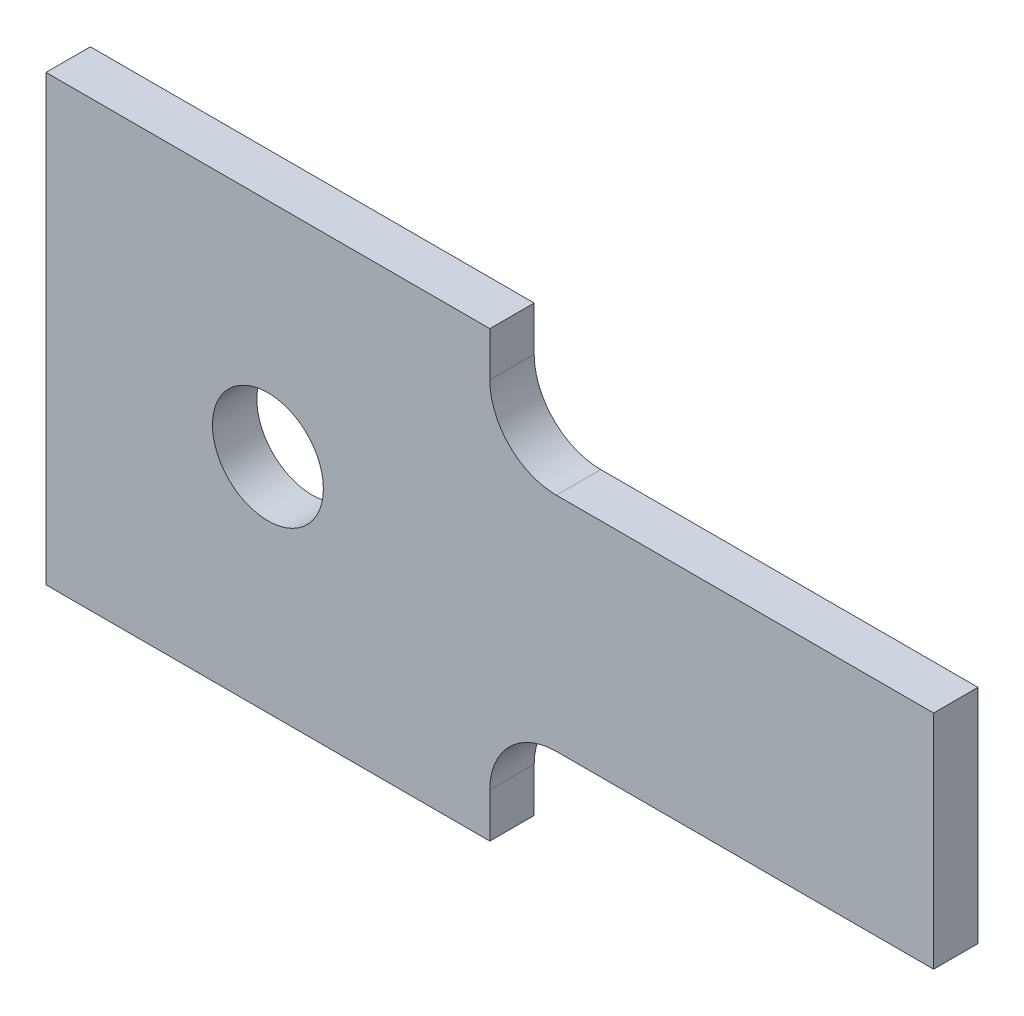
ISO-10303-21;
HEADER;
FILE_DESCRIPTION(('STEP AP214'),'2;1');
FILE_NAME('part.step','',(''),(''),'','','');
FILE_SCHEMA(('AUTOMOTIVE_DESIGN { 1 0 10303 214 1 1 1 1 }'));
ENDSEC;
DATA;
#1=APPLICATION_CONTEXT('core data for automotive mechanical design processes');
#2=APPLICATION_PROTOCOL_DEFINITION('international standard','automotive_design',2000,#1);
#3=PRODUCT_CONTEXT('',#1,'mechanical');
#4=PRODUCT('Part','Part','',(#3));
#5=PRODUCT_RELATED_PRODUCT_CATEGORY('part','',(#4));
#6=PRODUCT_DEFINITION_FORMATION('','',#4);
#7=PRODUCT_DEFINITION_CONTEXT('part definition',#1,'design');
#8=PRODUCT_DEFINITION('design','',#6,#7);
#9=PRODUCT_DEFINITION_SHAPE('','',#8);
#10=(LENGTH_UNIT() NAMED_UNIT(*) SI_UNIT(.MILLI.,.METRE.));
#11=(NAMED_UNIT(*) PLANE_ANGLE_UNIT() SI_UNIT($,.RADIAN.));
#12=(NAMED_UNIT(*) SI_UNIT($,.STERADIAN.) SOLID_ANGLE_UNIT());
#13=UNCERTAINTY_MEASURE_WITH_UNIT(LENGTH_MEASURE(1.E-05),#10,'distance_accuracy_value','');
#14=(GEOMETRIC_REPRESENTATION_CONTEXT(3) GLOBAL_UNCERTAINTY_ASSIGNED_CONTEXT((#13)) GLOBAL_UNIT_ASSIGNED_CONTEXT((#10,
#11,#12)) REPRESENTATION_CONTEXT('',''));
#15=CARTESIAN_POINT('',(0.,0.,0.));
#16=DIRECTION('',(0.,0.,1.));
#17=DIRECTION('',(1.,0.,0.));
#18=AXIS2_PLACEMENT_3D('',#15,#16,#17);
#19=CARTESIAN_POINT('',(0.,50.,10.));
#20=DIRECTION('',(1.,0.,0.));
#21=DIRECTION('',(0.,0.,-1.));
#22=AXIS2_PLACEMENT_3D('',#19,#20,#21);
#23=PLANE('',#22);
#24=DIRECTION('',(0.,-1.,0.));
#25=VECTOR('',#24,1.);
#26=CARTESIAN_POINT('',(0.,50.,5.));
#27=LINE('',#26,#25);
#28=CARTESIAN_POINT('',(0.,0.,5.));
#29=VERTEX_POINT('',#28);
#30=CARTESIAN_POINT('',(0.,-50.,5.));
#31=VERTEX_POINT('',#30);
#32=EDGE_CURVE('E11',#29,#31,#27,.T.);
#33=ORIENTED_EDGE('',*,*,#32,.F.);
#34=DIRECTION('',(0.,0.,1.));
#35=VECTOR('',#34,1.);
#36=CARTESIAN_POINT('',(0.,0.,10.));
#37=LINE('',#36,#35);
#38=CARTESIAN_POINT('',(0.,0.,0.));
#39=VERTEX_POINT('',#38);
#40=EDGE_CURVE('E162',#39,#29,#37,.T.);
#41=ORIENTED_EDGE('',*,*,#40,.F.);
#42=DIRECTION('',(0.,-1.,0.));
#43=VECTOR('',#42,1.);
#44=CARTESIAN_POINT('',(0.,50.,0.));
#45=LINE('',#44,#43);
#46=CARTESIAN_POINT('',(0.,-50.,0.));
#47=VERTEX_POINT('',#46);
#48=EDGE_CURVE('E196',#39,#47,#45,.T.);
#49=ORIENTED_EDGE('',*,*,#48,.T.);
#50=DIRECTION('',(0.,0.,-1.));
#51=VECTOR('',#50,1.);
#52=CARTESIAN_POINT('',(0.,-50.,10.));
#53=LINE('',#52,#51);
#54=EDGE_CURVE('E235',#31,#47,#53,.T.);
#55=ORIENTED_EDGE('',*,*,#54,.F.);
#56=EDGE_LOOP('',(#33,#41,#49,#55));
#57=FACE_BOUND('',#56,.T.);
#58=ADVANCED_FACE('F44',(#57),#23,.F.);
#59=DIRECTION('',(0.,-1.,0.));
#60=VECTOR('',#59,1.);
#61=CARTESIAN_POINT('',(0.,50.,5.));
#62=LINE('',#61,#60);
#63=CARTESIAN_POINT('',(0.,50.,5.));
#64=VERTEX_POINT('',#63);
#65=EDGE_CURVE('E48',#64,#29,#62,.T.);
#66=ORIENTED_EDGE('',*,*,#65,.F.);
#67=DIRECTION('',(0.,0.,-1.));
#68=VECTOR('',#67,1.);
#69=CARTESIAN_POINT('',(0.,50.,10.));
#70=LINE('',#69,#68);
#71=CARTESIAN_POINT('',(0.,50.,0.));
#72=VERTEX_POINT('',#71);
#73=EDGE_CURVE('E159',#64,#72,#70,.T.);
#74=ORIENTED_EDGE('',*,*,#73,.T.);
#75=EDGE_CURVE('E198',#72,#39,#45,.T.);
#76=ORIENTED_EDGE('',*,*,#75,.T.);
#77=ORIENTED_EDGE('',*,*,#40,.T.);
#78=EDGE_LOOP('',(#66,#74,#76,#77));
#79=FACE_BOUND('',#78,.T.);
#80=ADVANCED_FACE('F279',(#79),#23,.F.);
#81=CARTESIAN_POINT('',(0.,0.,10.));
#82=VERTEX_POINT('',#81);
#83=EDGE_CURVE('E142',#29,#82,#37,.T.);
#84=ORIENTED_EDGE('',*,*,#83,.F.);
#85=ORIENTED_EDGE('',*,*,#32,.T.);
#86=CARTESIAN_POINT('',(0.,-50.,10.));
#87=VERTEX_POINT('',#86);
#88=EDGE_CURVE('E164',#87,#31,#53,.T.);
#89=ORIENTED_EDGE('',*,*,#88,.F.);
#90=DIRECTION('',(0.,-1.,0.));
#91=VECTOR('',#90,1.);
#92=CARTESIAN_POINT('',(0.,50.,10.));
#93=LINE('',#92,#91);
#94=EDGE_CURVE('E146',#82,#87,#93,.T.);
#95=ORIENTED_EDGE('',*,*,#94,.F.);
#96=EDGE_LOOP('',(#84,#85,#89,#95));
#97=FACE_BOUND('',#96,.T.);
#98=ADVANCED_FACE('F174',(#97),#23,.F.);
#99=CARTESIAN_POINT('',(100.,50.,10.));
#100=DIRECTION('',(0.,-1.,0.));
#101=DIRECTION('',(1.,0.,0.));
#102=AXIS2_PLACEMENT_3D('',#99,#100,#101);
#103=PLANE('',#102);
#104=DIRECTION('',(-1.,0.,0.));
#105=VECTOR('',#104,1.);
#106=CARTESIAN_POINT('',(100.,50.,0.));
#107=LINE('',#106,#105);
#108=CARTESIAN_POINT('',(100.,50.,0.));
#109=VERTEX_POINT('',#108);
#110=EDGE_CURVE('E194',#109,#72,#107,.T.);
#111=ORIENTED_EDGE('',*,*,#110,.T.);
#112=ORIENTED_EDGE('',*,*,#73,.F.);
#113=CARTESIAN_POINT('',(0.,50.,10.));
#114=VERTEX_POINT('',#113);
#115=EDGE_CURVE('E141',#114,#64,#70,.T.);
#116=ORIENTED_EDGE('',*,*,#115,.F.);
#117=DIRECTION('',(-1.,0.,0.));
#118=VECTOR('',#117,1.);
#119=CARTESIAN_POINT('',(100.,50.,10.));
#120=LINE('',#119,#118);
#121=CARTESIAN_POINT('',(100.,50.,10.));
#122=VERTEX_POINT('',#121);
#123=EDGE_CURVE('E149',#122,#114,#120,.T.);
#124=ORIENTED_EDGE('',*,*,#123,.F.);
#125=DIRECTION('',(0.,0.,-1.));
#126=VECTOR('',#125,1.);
#127=CARTESIAN_POINT('',(100.,50.,10.));
#128=LINE('',#127,#126);
#129=EDGE_CURVE('E193',#122,#109,#128,.T.);
#130=ORIENTED_EDGE('',*,*,#129,.T.);
#131=EDGE_LOOP('',(#111,#112,#116,#124,#130));
#132=FACE_BOUND('',#131,.T.);
#133=ADVANCED_FACE('F46',(#132),#103,.F.);
#134=ORIENTED_EDGE('',*,*,#115,.T.);
#135=ORIENTED_EDGE('',*,*,#65,.T.);
#136=ORIENTED_EDGE('',*,*,#83,.T.);
#137=EDGE_CURVE('E137',#114,#82,#93,.T.);
#138=ORIENTED_EDGE('',*,*,#137,.F.);
#139=EDGE_LOOP('',(#134,#135,#136,#138));
#140=FACE_BOUND('',#139,.T.);
#141=ADVANCED_FACE('F139',(#140),#23,.F.);
#142=CARTESIAN_POINT('',(100.,-50.,10.));
#143=DIRECTION('',(0.,1.,0.));
#144=DIRECTION('',(-1.,0.,0.));
#145=AXIS2_PLACEMENT_3D('',#142,#143,#144);
#146=PLANE('',#145);
#147=DIRECTION('',(1.,0.,0.));
#148=VECTOR('',#147,1.);
#149=CARTESIAN_POINT('',(100.,-50.,0.));
#150=LINE('',#149,#148);
#151=CARTESIAN_POINT('',(100.,-50.,0.));
#152=VERTEX_POINT('',#151);
#153=EDGE_CURVE('E200',#47,#152,#150,.T.);
#154=ORIENTED_EDGE('',*,*,#153,.T.);
#155=DIRECTION('',(0.,0.,-1.));
#156=VECTOR('',#155,1.);
#157=CARTESIAN_POINT('',(100.,-50.,10.));
#158=LINE('',#157,#156);
#159=CARTESIAN_POINT('',(100.,-50.,10.));
#160=VERTEX_POINT('',#159);
#161=EDGE_CURVE('E233',#160,#152,#158,.T.);
#162=ORIENTED_EDGE('',*,*,#161,.F.);
#163=DIRECTION('',(1.,0.,0.));
#164=VECTOR('',#163,1.);
#165=CARTESIAN_POINT('',(100.,-50.,10.));
#166=LINE('',#165,#164);
#167=EDGE_CURVE('E145',#87,#160,#166,.T.);
#168=ORIENTED_EDGE('',*,*,#167,.F.);
#169=ORIENTED_EDGE('',*,*,#88,.T.);
#170=ORIENTED_EDGE('',*,*,#54,.T.);
#171=EDGE_LOOP('',(#154,#162,#168,#169,#170));
#172=FACE_BOUND('',#171,.T.);
#173=ADVANCED_FACE('F242',(#172),#146,.F.);
#174=CARTESIAN_POINT('',(100.,-40.0000000000001,10.));
#175=DIRECTION('',(-1.,0.,0.));
#176=DIRECTION('',(0.,0.,1.));
#177=AXIS2_PLACEMENT_3D('',#174,#175,#176);
#178=PLANE('',#177);
#179=DIRECTION('',(0.,1.,0.));
#180=VECTOR('',#179,1.);
#181=CARTESIAN_POINT('',(100.,-40.0000000000001,0.));
#182=LINE('',#181,#180);
#183=CARTESIAN_POINT('',(100.,-40.0000000000001,0.));
#184=VERTEX_POINT('',#183);
#185=EDGE_CURVE('E202',#152,#184,#182,.T.);
#186=ORIENTED_EDGE('',*,*,#185,.T.);
#187=DIRECTION('',(0.,0.,-1.));
#188=VECTOR('',#187,1.);
#189=CARTESIAN_POINT('',(100.,-40.0000000000001,10.));
#190=LINE('',#189,#188);
#191=CARTESIAN_POINT('',(100.,-40.0000000000001,10.));
#192=VERTEX_POINT('',#191);
#193=EDGE_CURVE('E231',#192,#184,#190,.T.);
#194=ORIENTED_EDGE('',*,*,#193,.F.);
#195=DIRECTION('',(0.,1.,0.));
#196=VECTOR('',#195,1.);
#197=CARTESIAN_POINT('',(100.,-40.0000000000001,10.));
#198=LINE('',#197,#196);
#199=EDGE_CURVE('E180',#160,#192,#198,.T.);
#200=ORIENTED_EDGE('',*,*,#199,.F.);
#201=ORIENTED_EDGE('',*,*,#161,.T.);
#202=EDGE_LOOP('',(#186,#194,#200,#201));
#203=FACE_BOUND('',#202,.T.);
#204=ADVANCED_FACE('F246',(#203),#178,.F.);
#205=CARTESIAN_POINT('',(115.,-40.,10.));
#206=DIRECTION('',(0.,0.,-1.));
#207=DIRECTION('',(-1.,0.,0.));
#208=AXIS2_PLACEMENT_3D('',#205,#206,#207);
#209=CYLINDRICAL_SURFACE('',#208,15.);
#210=CARTESIAN_POINT('',(115.,-40.,0.));
#211=DIRECTION('',(0.,0.,-1.));
#212=DIRECTION('',(1.,0.,0.));
#213=AXIS2_PLACEMENT_3D('',#210,#211,#212);
#214=CIRCLE('',#213,15.);
#215=CARTESIAN_POINT('',(115.,-25.,0.));
#216=VERTEX_POINT('',#215);
#217=EDGE_CURVE('E204',#184,#216,#214,.T.);
#218=ORIENTED_EDGE('',*,*,#217,.T.);
#219=DIRECTION('',(0.,0.,-1.));
#220=VECTOR('',#219,1.);
#221=CARTESIAN_POINT('',(115.,-25.,10.));
#222=LINE('',#221,#220);
#223=CARTESIAN_POINT('',(115.,-25.,10.));
#224=VERTEX_POINT('',#223);
#225=EDGE_CURVE('E228',#224,#216,#222,.T.);
#226=ORIENTED_EDGE('',*,*,#225,.F.);
#227=CARTESIAN_POINT('',(115.,-40.,10.));
#228=DIRECTION('',(0.,0.,-1.));
#229=DIRECTION('',(1.,0.,0.));
#230=AXIS2_PLACEMENT_3D('',#227,#228,#229);
#231=CIRCLE('',#230,15.);
#232=EDGE_CURVE('E182',#192,#224,#231,.T.);
#233=ORIENTED_EDGE('',*,*,#232,.F.);
#234=ORIENTED_EDGE('',*,*,#193,.T.);
#235=EDGE_LOOP('',(#218,#226,#233,#234));
#236=FACE_BOUND('',#235,.T.);
#237=ADVANCED_FACE('F249',(#236),#209,.F.);
#238=CARTESIAN_POINT('',(200.,-25.,10.));
#239=DIRECTION('',(0.,1.,0.));
#240=DIRECTION('',(-1.,0.,0.));
#241=AXIS2_PLACEMENT_3D('',#238,#239,#240);
#242=PLANE('',#241);
#243=DIRECTION('',(1.,0.,0.));
#244=VECTOR('',#243,1.);
#245=CARTESIAN_POINT('',(200.,-25.,0.));
#246=LINE('',#245,#244);
#247=CARTESIAN_POINT('',(200.,-25.,0.));
#248=VERTEX_POINT('',#247);
#249=EDGE_CURVE('E206',#216,#248,#246,.T.);
#250=ORIENTED_EDGE('',*,*,#249,.T.);
#251=DIRECTION('',(0.,0.,-1.));
#252=VECTOR('',#251,1.);
#253=CARTESIAN_POINT('',(200.,-25.,10.));
#254=LINE('',#253,#252);
#255=CARTESIAN_POINT('',(200.,-25.,10.));
#256=VERTEX_POINT('',#255);
#257=EDGE_CURVE('E225',#256,#248,#254,.T.);
#258=ORIENTED_EDGE('',*,*,#257,.F.);
#259=DIRECTION('',(1.,0.,0.));
#260=VECTOR('',#259,1.);
#261=CARTESIAN_POINT('',(200.,-25.,10.));
#262=LINE('',#261,#260);
#263=EDGE_CURVE('E184',#224,#256,#262,.T.);
#264=ORIENTED_EDGE('',*,*,#263,.F.);
#265=ORIENTED_EDGE('',*,*,#225,.T.);
#266=EDGE_LOOP('',(#250,#258,#264,#265));
#267=FACE_BOUND('',#266,.T.);
#268=ADVANCED_FACE('F254',(#267),#242,.F.);
#269=CARTESIAN_POINT('',(200.,-25.,10.));
#270=DIRECTION('',(-1.,0.,0.));
#271=DIRECTION('',(0.,0.,1.));
#272=AXIS2_PLACEMENT_3D('',#269,#270,#271);
#273=PLANE('',#272);
#274=DIRECTION('',(0.,1.,0.));
#275=VECTOR('',#274,1.);
#276=CARTESIAN_POINT('',(200.,-25.,0.));
#277=LINE('',#276,#275);
#278=CARTESIAN_POINT('',(200.,25.,0.));
#279=VERTEX_POINT('',#278);
#280=EDGE_CURVE('E208',#248,#279,#277,.T.);
#281=ORIENTED_EDGE('',*,*,#280,.T.);
#282=DIRECTION('',(0.,0.,-1.));
#283=VECTOR('',#282,1.);
#284=CARTESIAN_POINT('',(200.,25.,10.));
#285=LINE('',#284,#283);
#286=CARTESIAN_POINT('',(200.,25.,10.));
#287=VERTEX_POINT('',#286);
#288=EDGE_CURVE('E222',#287,#279,#285,.T.);
#289=ORIENTED_EDGE('',*,*,#288,.F.);
#290=DIRECTION('',(0.,1.,0.));
#291=VECTOR('',#290,1.);
#292=CARTESIAN_POINT('',(200.,-25.,10.));
#293=LINE('',#292,#291);
#294=EDGE_CURVE('E186',#256,#287,#293,.T.);
#295=ORIENTED_EDGE('',*,*,#294,.F.);
#296=ORIENTED_EDGE('',*,*,#257,.T.);
#297=EDGE_LOOP('',(#281,#289,#295,#296));
#298=FACE_BOUND('',#297,.T.);
#299=ADVANCED_FACE('F260',(#298),#273,.F.);
#300=CARTESIAN_POINT('',(200.,25.,10.));
#301=DIRECTION('',(0.,-1.,0.));
#302=DIRECTION('',(1.,0.,0.));
#303=AXIS2_PLACEMENT_3D('',#300,#301,#302);
#304=PLANE('',#303);
#305=DIRECTION('',(-1.,0.,0.));
#306=VECTOR('',#305,1.);
#307=CARTESIAN_POINT('',(200.,25.,0.));
#308=LINE('',#307,#306);
#309=CARTESIAN_POINT('',(115.,25.,0.));
#310=VERTEX_POINT('',#309);
#311=EDGE_CURVE('E210',#279,#310,#308,.T.);
#312=ORIENTED_EDGE('',*,*,#311,.T.);
#313=DIRECTION('',(0.,0.,-1.));
#314=VECTOR('',#313,1.);
#315=CARTESIAN_POINT('',(115.,25.,10.));
#316=LINE('',#315,#314);
#317=CARTESIAN_POINT('',(115.,25.,10.));
#318=VERTEX_POINT('',#317);
#319=EDGE_CURVE('E219',#318,#310,#316,.T.);
#320=ORIENTED_EDGE('',*,*,#319,.F.);
#321=DIRECTION('',(-1.,0.,0.));
#322=VECTOR('',#321,1.);
#323=CARTESIAN_POINT('',(200.,25.,10.));
#324=LINE('',#323,#322);
#325=EDGE_CURVE('E188',#287,#318,#324,.T.);
#326=ORIENTED_EDGE('',*,*,#325,.F.);
#327=ORIENTED_EDGE('',*,*,#288,.T.);
#328=EDGE_LOOP('',(#312,#320,#326,#327));
#329=FACE_BOUND('',#328,.T.);
#330=ADVANCED_FACE('F264',(#329),#304,.F.);
#331=CARTESIAN_POINT('',(115.,40.,10.));
#332=DIRECTION('',(0.,0.,-1.));
#333=DIRECTION('',(-1.,0.,0.));
#334=AXIS2_PLACEMENT_3D('',#331,#332,#333);
#335=CYLINDRICAL_SURFACE('',#334,15.);
#336=CARTESIAN_POINT('',(115.,40.,0.));
#337=DIRECTION('',(0.,0.,-1.));
#338=DIRECTION('',(-1.,0.,0.));
#339=AXIS2_PLACEMENT_3D('',#336,#337,#338);
#340=CIRCLE('',#339,15.);
#341=CARTESIAN_POINT('',(100.,40.0000000000001,0.));
#342=VERTEX_POINT('',#341);
#343=EDGE_CURVE('E212',#310,#342,#340,.T.);
#344=ORIENTED_EDGE('',*,*,#343,.T.);
#345=DIRECTION('',(0.,0.,-1.));
#346=VECTOR('',#345,1.);
#347=CARTESIAN_POINT('',(100.,40.0000000000001,10.));
#348=LINE('',#347,#346);
#349=CARTESIAN_POINT('',(100.,40.0000000000001,10.));
#350=VERTEX_POINT('',#349);
#351=EDGE_CURVE('E216',#350,#342,#348,.T.);
#352=ORIENTED_EDGE('',*,*,#351,.F.);
#353=CARTESIAN_POINT('',(115.,40.,10.));
#354=DIRECTION('',(0.,0.,-1.));
#355=DIRECTION('',(-1.,0.,0.));
#356=AXIS2_PLACEMENT_3D('',#353,#354,#355);
#357=CIRCLE('',#356,15.);
#358=EDGE_CURVE('E190',#318,#350,#357,.T.);
#359=ORIENTED_EDGE('',*,*,#358,.F.);
#360=ORIENTED_EDGE('',*,*,#319,.T.);
#361=EDGE_LOOP('',(#344,#352,#359,#360));
#362=FACE_BOUND('',#361,.T.);
#363=ADVANCED_FACE('F269',(#362),#335,.F.);
#364=CARTESIAN_POINT('',(100.,40.0000000000001,10.));
#365=DIRECTION('',(-1.,0.,0.));
#366=DIRECTION('',(0.,0.,1.));
#367=AXIS2_PLACEMENT_3D('',#364,#365,#366);
#368=PLANE('',#367);
#369=DIRECTION('',(0.,1.,0.));
#370=VECTOR('',#369,1.);
#371=CARTESIAN_POINT('',(100.,40.0000000000001,0.));
#372=LINE('',#371,#370);
#373=EDGE_CURVE('E156',#342,#109,#372,.T.);
#374=ORIENTED_EDGE('',*,*,#373,.T.);
#375=ORIENTED_EDGE('',*,*,#129,.F.);
#376=DIRECTION('',(0.,1.,0.));
#377=VECTOR('',#376,1.);
#378=CARTESIAN_POINT('',(100.,40.0000000000001,10.));
#379=LINE('',#378,#377);
#380=EDGE_CURVE('E152',#350,#122,#379,.T.);
#381=ORIENTED_EDGE('',*,*,#380,.F.);
#382=ORIENTED_EDGE('',*,*,#351,.T.);
#383=EDGE_LOOP('',(#374,#375,#381,#382));
#384=FACE_BOUND('',#383,.T.);
#385=ADVANCED_FACE('F272',(#384),#368,.F.);
#386=CARTESIAN_POINT('',(115.,-40.,10.));
#387=DIRECTION('',(0.,0.,1.));
#388=DIRECTION('',(1.,0.,0.));
#389=AXIS2_PLACEMENT_3D('',#386,#387,#388);
#390=PLANE('',#389);
#391=CARTESIAN_POINT('',(50.,0.,10.));
#392=DIRECTION('',(0.,0.,1.));
#393=DIRECTION('',(1.,0.,0.));
#394=AXIS2_PLACEMENT_3D('',#391,#392,#393);
#395=CIRCLE('',#394,12.5);
#396=CARTESIAN_POINT('',(62.5,0.,10.));
#397=VERTEX_POINT('',#396);
#398=EDGE_CURVE('E320',#397,#397,#395,.T.);
#399=ORIENTED_EDGE('',*,*,#398,.F.);
#400=EDGE_LOOP('',(#399));
#401=FACE_BOUND('',#400,.T.);
#402=ORIENTED_EDGE('',*,*,#123,.T.);
#403=ORIENTED_EDGE('',*,*,#137,.T.);
#404=ORIENTED_EDGE('',*,*,#94,.T.);
#405=ORIENTED_EDGE('',*,*,#167,.T.);
#406=ORIENTED_EDGE('',*,*,#199,.T.);
#407=ORIENTED_EDGE('',*,*,#232,.T.);
#408=ORIENTED_EDGE('',*,*,#263,.T.);
#409=ORIENTED_EDGE('',*,*,#294,.T.);
#410=ORIENTED_EDGE('',*,*,#325,.T.);
#411=ORIENTED_EDGE('',*,*,#358,.T.);
#412=ORIENTED_EDGE('',*,*,#380,.T.);
#413=EDGE_LOOP('',(#402,#403,#404,#405,#406,#407,#408,#409,#410,#411,#412));
#414=FACE_BOUND('',#413,.T.);
#415=ADVANCED_FACE('F150',(#401,#414),#390,.T.);
#416=CARTESIAN_POINT('',(115.,-40.,0.));
#417=DIRECTION('',(0.,0.,1.));
#418=DIRECTION('',(1.,0.,0.));
#419=AXIS2_PLACEMENT_3D('',#416,#417,#418);
#420=PLANE('',#419);
#421=CARTESIAN_POINT('',(50.,0.,0.));
#422=DIRECTION('',(0.,0.,1.));
#423=DIRECTION('',(1.,0.,0.));
#424=AXIS2_PLACEMENT_3D('',#421,#422,#423);
#425=CIRCLE('',#424,12.5);
#426=CARTESIAN_POINT('',(62.5,0.,0.));
#427=VERTEX_POINT('',#426);
#428=EDGE_CURVE('E197',#427,#427,#425,.T.);
#429=ORIENTED_EDGE('',*,*,#428,.T.);
#430=EDGE_LOOP('',(#429));
#431=FACE_BOUND('',#430,.T.);
#432=ORIENTED_EDGE('',*,*,#110,.F.);
#433=ORIENTED_EDGE('',*,*,#373,.F.);
#434=ORIENTED_EDGE('',*,*,#343,.F.);
#435=ORIENTED_EDGE('',*,*,#311,.F.);
#436=ORIENTED_EDGE('',*,*,#280,.F.);
#437=ORIENTED_EDGE('',*,*,#249,.F.);
#438=ORIENTED_EDGE('',*,*,#217,.F.);
#439=ORIENTED_EDGE('',*,*,#185,.F.);
#440=ORIENTED_EDGE('',*,*,#153,.F.);
#441=ORIENTED_EDGE('',*,*,#48,.F.);
#442=ORIENTED_EDGE('',*,*,#75,.F.);
#443=EDGE_LOOP('',(#432,#433,#434,#435,#436,#437,#438,#439,#440,#441,#442));
#444=FACE_BOUND('',#443,.T.);
#445=ADVANCED_FACE('F276',(#431,#444),#420,.F.);
#446=CARTESIAN_POINT('',(50.,0.,0.));
#447=DIRECTION('',(0.,0.,1.));
#448=DIRECTION('',(1.,0.,0.));
#449=AXIS2_PLACEMENT_3D('',#446,#447,#448);
#450=CYLINDRICAL_SURFACE('',#449,12.5);
#451=ORIENTED_EDGE('',*,*,#428,.F.);
#452=EDGE_LOOP('',(#451));
#453=FACE_BOUND('',#452,.T.);
#454=ORIENTED_EDGE('',*,*,#398,.T.);
#455=EDGE_LOOP('',(#454));
#456=FACE_BOUND('',#455,.T.);
#457=ADVANCED_FACE('F306',(#453,#456),#450,.F.);
#458=CLOSED_SHELL('',(#58,#80,#98,#133,#141,#173,#204,#237,#268,#299,#330,#363,#385,#415,#445,#457));
#459=MANIFOLD_SOLID_BREP('B2',#458);
#460=ADVANCED_BREP_SHAPE_REPRESENTATION('',(#18,#459),#14);
#461=SHAPE_DEFINITION_REPRESENTATION(#9,#460);
ENDSEC;
END-ISO-10303-21;
